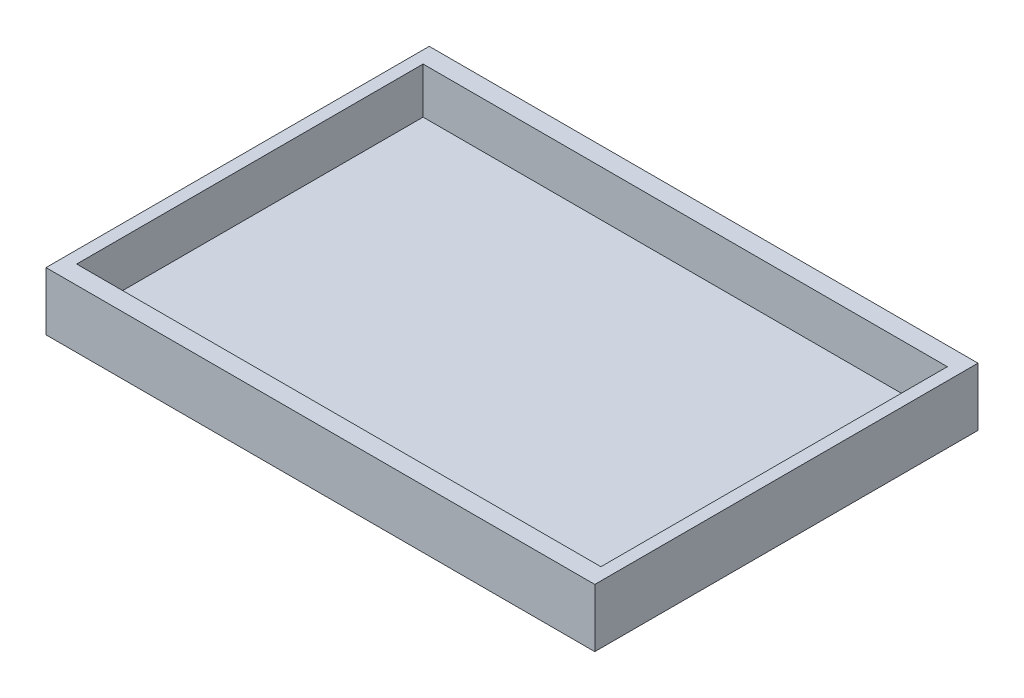
ISO-10303-21;
HEADER;
FILE_DESCRIPTION(('STEP AP214'),'2;1');
FILE_NAME('part.step','',(''),(''),'','','');
FILE_SCHEMA(('AUTOMOTIVE_DESIGN { 1 0 10303 214 1 1 1 1 }'));
ENDSEC;
DATA;
#1=APPLICATION_CONTEXT('core data for automotive mechanical design processes');
#2=APPLICATION_PROTOCOL_DEFINITION('international standard','automotive_design',2000,#1);
#3=PRODUCT_CONTEXT('',#1,'mechanical');
#4=PRODUCT('Part','Part','',(#3));
#5=PRODUCT_RELATED_PRODUCT_CATEGORY('part','',(#4));
#6=PRODUCT_DEFINITION_FORMATION('','',#4);
#7=PRODUCT_DEFINITION_CONTEXT('part definition',#1,'design');
#8=PRODUCT_DEFINITION('design','',#6,#7);
#9=PRODUCT_DEFINITION_SHAPE('','',#8);
#10=(LENGTH_UNIT() NAMED_UNIT(*) SI_UNIT(.MILLI.,.METRE.));
#11=(NAMED_UNIT(*) PLANE_ANGLE_UNIT() SI_UNIT($,.RADIAN.));
#12=(NAMED_UNIT(*) SI_UNIT($,.STERADIAN.) SOLID_ANGLE_UNIT());
#13=UNCERTAINTY_MEASURE_WITH_UNIT(LENGTH_MEASURE(1.E-05),#10,'distance_accuracy_value','');
#14=(GEOMETRIC_REPRESENTATION_CONTEXT(3) GLOBAL_UNCERTAINTY_ASSIGNED_CONTEXT((#13)) GLOBAL_UNIT_ASSIGNED_CONTEXT((#10,
#11,#12)) REPRESENTATION_CONTEXT('',''));
#15=CARTESIAN_POINT('',(0.,0.,0.));
#16=DIRECTION('',(0.,0.,1.));
#17=DIRECTION('',(1.,0.,0.));
#18=AXIS2_PLACEMENT_3D('',#15,#16,#17);
#19=CARTESIAN_POINT('',(44.75,2.,-31.25));
#20=DIRECTION('',(-1.,0.,0.));
#21=DIRECTION('',(0.,0.,1.));
#22=AXIS2_PLACEMENT_3D('',#19,#20,#21);
#23=PLANE('',#22);
#24=DIRECTION('',(0.,0.,-1.));
#25=VECTOR('',#24,1.);
#26=CARTESIAN_POINT('',(44.75,0.,-31.25));
#27=LINE('',#26,#25);
#28=CARTESIAN_POINT('',(44.75,0.,31.25));
#29=VERTEX_POINT('',#28);
#30=CARTESIAN_POINT('',(44.75,0.,-31.25));
#31=VERTEX_POINT('',#30);
#32=EDGE_CURVE('E161',#29,#31,#27,.T.);
#33=ORIENTED_EDGE('',*,*,#32,.T.);
#34=DIRECTION('',(0.,-1.,0.));
#35=VECTOR('',#34,1.);
#36=CARTESIAN_POINT('',(44.75,2.,-31.25));
#37=LINE('',#36,#35);
#38=CARTESIAN_POINT('',(44.75,9.5,-31.25));
#39=VERTEX_POINT('',#38);
#40=EDGE_CURVE('E11',#39,#31,#37,.T.);
#41=ORIENTED_EDGE('',*,*,#40,.F.);
#42=DIRECTION('',(0.,0.,-1.));
#43=VECTOR('',#42,1.);
#44=CARTESIAN_POINT('',(44.75,9.5,0.));
#45=LINE('',#44,#43);
#46=CARTESIAN_POINT('',(44.75,9.5,31.25));
#47=VERTEX_POINT('',#46);
#48=EDGE_CURVE('E123',#47,#39,#45,.T.);
#49=ORIENTED_EDGE('',*,*,#48,.F.);
#50=DIRECTION('',(0.,-1.,0.));
#51=VECTOR('',#50,1.);
#52=CARTESIAN_POINT('',(44.75,2.,31.25));
#53=LINE('',#52,#51);
#54=EDGE_CURVE('E114',#47,#29,#53,.T.);
#55=ORIENTED_EDGE('',*,*,#54,.T.);
#56=EDGE_LOOP('',(#33,#41,#49,#55));
#57=FACE_BOUND('',#56,.T.);
#58=ADVANCED_FACE('F41',(#57),#23,.F.);
#59=CARTESIAN_POINT('',(-44.75,2.,-31.25));
#60=DIRECTION('',(0.,0.,1.));
#61=DIRECTION('',(1.,0.,0.));
#62=AXIS2_PLACEMENT_3D('',#59,#60,#61);
#63=PLANE('',#62);
#64=DIRECTION('',(-1.,0.,0.));
#65=VECTOR('',#64,1.);
#66=CARTESIAN_POINT('',(-44.75,0.,-31.25));
#67=LINE('',#66,#65);
#68=CARTESIAN_POINT('',(-44.75,0.,-31.25));
#69=VERTEX_POINT('',#68);
#70=EDGE_CURVE('E164',#31,#69,#67,.T.);
#71=ORIENTED_EDGE('',*,*,#70,.T.);
#72=DIRECTION('',(0.,-1.,0.));
#73=VECTOR('',#72,1.);
#74=CARTESIAN_POINT('',(-44.75,2.,-31.25));
#75=LINE('',#74,#73);
#76=CARTESIAN_POINT('',(-44.75,9.5,-31.25));
#77=VERTEX_POINT('',#76);
#78=EDGE_CURVE('E48',#77,#69,#75,.T.);
#79=ORIENTED_EDGE('',*,*,#78,.F.);
#80=DIRECTION('',(-1.,0.,0.));
#81=VECTOR('',#80,1.);
#82=CARTESIAN_POINT('',(0.,9.5,-31.25));
#83=LINE('',#82,#81);
#84=EDGE_CURVE('E129',#39,#77,#83,.T.);
#85=ORIENTED_EDGE('',*,*,#84,.F.);
#86=ORIENTED_EDGE('',*,*,#40,.T.);
#87=EDGE_LOOP('',(#71,#79,#85,#86));
#88=FACE_BOUND('',#87,.T.);
#89=ADVANCED_FACE('F174',(#88),#63,.F.);
#90=CARTESIAN_POINT('',(-44.75,2.,-31.25));
#91=DIRECTION('',(1.,0.,0.));
#92=DIRECTION('',(0.,0.,-1.));
#93=AXIS2_PLACEMENT_3D('',#90,#91,#92);
#94=PLANE('',#93);
#95=DIRECTION('',(0.,0.,1.));
#96=VECTOR('',#95,1.);
#97=CARTESIAN_POINT('',(-44.75,0.,-31.25));
#98=LINE('',#97,#96);
#99=CARTESIAN_POINT('',(-44.75,0.,31.25));
#100=VERTEX_POINT('',#99);
#101=EDGE_CURVE('E111',#69,#100,#98,.T.);
#102=ORIENTED_EDGE('',*,*,#101,.T.);
#103=DIRECTION('',(0.,-1.,0.));
#104=VECTOR('',#103,1.);
#105=CARTESIAN_POINT('',(-44.75,2.,31.25));
#106=LINE('',#105,#104);
#107=CARTESIAN_POINT('',(-44.75,9.5,31.25));
#108=VERTEX_POINT('',#107);
#109=EDGE_CURVE('E104',#108,#100,#106,.T.);
#110=ORIENTED_EDGE('',*,*,#109,.F.);
#111=DIRECTION('',(0.,0.,1.));
#112=VECTOR('',#111,1.);
#113=CARTESIAN_POINT('',(-44.75,9.5,0.));
#114=LINE('',#113,#112);
#115=EDGE_CURVE('E109',#77,#108,#114,.T.);
#116=ORIENTED_EDGE('',*,*,#115,.F.);
#117=ORIENTED_EDGE('',*,*,#78,.T.);
#118=EDGE_LOOP('',(#102,#110,#116,#117));
#119=FACE_BOUND('',#118,.T.);
#120=ADVANCED_FACE('F106',(#119),#94,.F.);
#121=CARTESIAN_POINT('',(-44.75,2.,31.25));
#122=DIRECTION('',(0.,0.,-1.));
#123=DIRECTION('',(-1.,0.,0.));
#124=AXIS2_PLACEMENT_3D('',#121,#122,#123);
#125=PLANE('',#124);
#126=DIRECTION('',(1.,0.,0.));
#127=VECTOR('',#126,1.);
#128=CARTESIAN_POINT('',(-44.75,0.,31.25));
#129=LINE('',#128,#127);
#130=EDGE_CURVE('E167',#100,#29,#129,.T.);
#131=ORIENTED_EDGE('',*,*,#130,.T.);
#132=ORIENTED_EDGE('',*,*,#54,.F.);
#133=DIRECTION('',(1.,0.,0.));
#134=VECTOR('',#133,1.);
#135=CARTESIAN_POINT('',(0.,9.5,31.25));
#136=LINE('',#135,#134);
#137=EDGE_CURVE('E117',#108,#47,#136,.T.);
#138=ORIENTED_EDGE('',*,*,#137,.F.);
#139=ORIENTED_EDGE('',*,*,#109,.T.);
#140=EDGE_LOOP('',(#131,#132,#138,#139));
#141=FACE_BOUND('',#140,.T.);
#142=ADVANCED_FACE('F118',(#141),#125,.F.);
#143=CARTESIAN_POINT('',(0.,0.,0.));
#144=DIRECTION('',(0.,1.,0.));
#145=DIRECTION('',(0.,0.,1.));
#146=AXIS2_PLACEMENT_3D('',#143,#144,#145);
#147=PLANE('',#146);
#148=ORIENTED_EDGE('',*,*,#32,.F.);
#149=ORIENTED_EDGE('',*,*,#130,.F.);
#150=ORIENTED_EDGE('',*,*,#101,.F.);
#151=ORIENTED_EDGE('',*,*,#70,.F.);
#152=EDGE_LOOP('',(#148,#149,#150,#151));
#153=FACE_BOUND('',#152,.T.);
#154=ADVANCED_FACE('F172',(#153),#147,.F.);
#155=CARTESIAN_POINT('',(-42.75,9.5,0.));
#156=DIRECTION('',(1.,0.,0.));
#157=DIRECTION('',(0.,0.,-1.));
#158=AXIS2_PLACEMENT_3D('',#155,#156,#157);
#159=PLANE('',#158);
#160=DIRECTION('',(0.,0.,1.));
#161=VECTOR('',#160,1.);
#162=CARTESIAN_POINT('',(-42.75,2.,0.));
#163=LINE('',#162,#161);
#164=CARTESIAN_POINT('',(-42.75,2.,-28.25));
#165=VERTEX_POINT('',#164);
#166=CARTESIAN_POINT('',(-42.75,2.,28.25));
#167=VERTEX_POINT('',#166);
#168=EDGE_CURVE('E148',#165,#167,#163,.T.);
#169=ORIENTED_EDGE('',*,*,#168,.F.);
#170=DIRECTION('',(0.,-1.,0.));
#171=VECTOR('',#170,1.);
#172=CARTESIAN_POINT('',(-42.75,9.5,-28.25));
#173=LINE('',#172,#171);
#174=CARTESIAN_POINT('',(-42.75,9.5,-28.25));
#175=VERTEX_POINT('',#174);
#176=EDGE_CURVE('E159',#175,#165,#173,.T.);
#177=ORIENTED_EDGE('',*,*,#176,.F.);
#178=DIRECTION('',(0.,0.,1.));
#179=VECTOR('',#178,1.);
#180=CARTESIAN_POINT('',(-42.75,9.5,0.));
#181=LINE('',#180,#179);
#182=CARTESIAN_POINT('',(-42.75,9.5,28.25));
#183=VERTEX_POINT('',#182);
#184=EDGE_CURVE('E136',#175,#183,#181,.T.);
#185=ORIENTED_EDGE('',*,*,#184,.T.);
#186=DIRECTION('',(0.,-1.,0.));
#187=VECTOR('',#186,1.);
#188=CARTESIAN_POINT('',(-42.75,9.5,28.25));
#189=LINE('',#188,#187);
#190=EDGE_CURVE('E147',#183,#167,#189,.T.);
#191=ORIENTED_EDGE('',*,*,#190,.T.);
#192=EDGE_LOOP('',(#169,#177,#185,#191));
#193=FACE_BOUND('',#192,.T.);
#194=ADVANCED_FACE('F186',(#193),#159,.T.);
#195=CARTESIAN_POINT('',(0.,9.5,-28.25));
#196=DIRECTION('',(0.,0.,-1.));
#197=DIRECTION('',(-1.,0.,0.));
#198=AXIS2_PLACEMENT_3D('',#195,#196,#197);
#199=PLANE('',#198);
#200=DIRECTION('',(1.,0.,0.));
#201=VECTOR('',#200,1.);
#202=CARTESIAN_POINT('',(0.,2.,-28.25));
#203=LINE('',#202,#201);
#204=CARTESIAN_POINT('',(42.75,2.,-28.25));
#205=VERTEX_POINT('',#204);
#206=EDGE_CURVE('E55',#165,#205,#203,.T.);
#207=ORIENTED_EDGE('',*,*,#206,.T.);
#208=DIRECTION('',(0.,-1.,0.));
#209=VECTOR('',#208,1.);
#210=CARTESIAN_POINT('',(42.75,9.5,-28.25));
#211=LINE('',#210,#209);
#212=CARTESIAN_POINT('',(42.75,9.5,-28.25));
#213=VERTEX_POINT('',#212);
#214=EDGE_CURVE('E157',#213,#205,#211,.T.);
#215=ORIENTED_EDGE('',*,*,#214,.F.);
#216=DIRECTION('',(1.,0.,0.));
#217=VECTOR('',#216,1.);
#218=CARTESIAN_POINT('',(0.,9.5,-28.25));
#219=LINE('',#218,#217);
#220=EDGE_CURVE('E139',#175,#213,#219,.T.);
#221=ORIENTED_EDGE('',*,*,#220,.F.);
#222=ORIENTED_EDGE('',*,*,#176,.T.);
#223=EDGE_LOOP('',(#207,#215,#221,#222));
#224=FACE_BOUND('',#223,.T.);
#225=ADVANCED_FACE('F192',(#224),#199,.F.);
#226=CARTESIAN_POINT('',(42.75,9.5,0.));
#227=DIRECTION('',(1.,0.,0.));
#228=DIRECTION('',(0.,0.,-1.));
#229=AXIS2_PLACEMENT_3D('',#226,#227,#228);
#230=PLANE('',#229);
#231=DIRECTION('',(0.,0.,1.));
#232=VECTOR('',#231,1.);
#233=CARTESIAN_POINT('',(42.75,2.,0.));
#234=LINE('',#233,#232);
#235=CARTESIAN_POINT('',(42.75,2.,28.25));
#236=VERTEX_POINT('',#235);
#237=EDGE_CURVE('E60',#205,#236,#234,.T.);
#238=ORIENTED_EDGE('',*,*,#237,.T.);
#239=DIRECTION('',(0.,-1.,0.));
#240=VECTOR('',#239,1.);
#241=CARTESIAN_POINT('',(42.75,9.5,28.25));
#242=LINE('',#241,#240);
#243=CARTESIAN_POINT('',(42.75,9.5,28.25));
#244=VERTEX_POINT('',#243);
#245=EDGE_CURVE('E154',#244,#236,#242,.T.);
#246=ORIENTED_EDGE('',*,*,#245,.F.);
#247=DIRECTION('',(0.,0.,1.));
#248=VECTOR('',#247,1.);
#249=CARTESIAN_POINT('',(42.75,9.5,0.));
#250=LINE('',#249,#248);
#251=EDGE_CURVE('E142',#213,#244,#250,.T.);
#252=ORIENTED_EDGE('',*,*,#251,.F.);
#253=ORIENTED_EDGE('',*,*,#214,.T.);
#254=EDGE_LOOP('',(#238,#246,#252,#253));
#255=FACE_BOUND('',#254,.T.);
#256=ADVANCED_FACE('F196',(#255),#230,.F.);
#257=CARTESIAN_POINT('',(0.,9.5,28.25));
#258=DIRECTION('',(0.,0.,-1.));
#259=DIRECTION('',(-1.,0.,0.));
#260=AXIS2_PLACEMENT_3D('',#257,#258,#259);
#261=PLANE('',#260);
#262=DIRECTION('',(1.,0.,0.));
#263=VECTOR('',#262,1.);
#264=CARTESIAN_POINT('',(0.,2.,28.25));
#265=LINE('',#264,#263);
#266=EDGE_CURVE('E130',#167,#236,#265,.T.);
#267=ORIENTED_EDGE('',*,*,#266,.F.);
#268=ORIENTED_EDGE('',*,*,#190,.F.);
#269=DIRECTION('',(1.,0.,0.));
#270=VECTOR('',#269,1.);
#271=CARTESIAN_POINT('',(0.,9.5,28.25));
#272=LINE('',#271,#270);
#273=EDGE_CURVE('E144',#183,#244,#272,.T.);
#274=ORIENTED_EDGE('',*,*,#273,.T.);
#275=ORIENTED_EDGE('',*,*,#245,.T.);
#276=EDGE_LOOP('',(#267,#268,#274,#275));
#277=FACE_BOUND('',#276,.T.);
#278=ADVANCED_FACE('F200',(#277),#261,.T.);
#279=CARTESIAN_POINT('',(0.,9.5,0.));
#280=DIRECTION('',(0.,1.,0.));
#281=DIRECTION('',(0.,0.,1.));
#282=AXIS2_PLACEMENT_3D('',#279,#280,#281);
#283=PLANE('',#282);
#284=ORIENTED_EDGE('',*,*,#115,.T.);
#285=ORIENTED_EDGE('',*,*,#137,.T.);
#286=ORIENTED_EDGE('',*,*,#48,.T.);
#287=ORIENTED_EDGE('',*,*,#84,.T.);
#288=EDGE_LOOP('',(#284,#285,#286,#287));
#289=FACE_BOUND('',#288,.T.);
#290=ORIENTED_EDGE('',*,*,#184,.F.);
#291=ORIENTED_EDGE('',*,*,#220,.T.);
#292=ORIENTED_EDGE('',*,*,#251,.T.);
#293=ORIENTED_EDGE('',*,*,#273,.F.);
#294=EDGE_LOOP('',(#290,#291,#292,#293));
#295=FACE_BOUND('',#294,.T.);
#296=ADVANCED_FACE('F126',(#289,#295),#283,.T.);
#297=CARTESIAN_POINT('',(0.,2.,0.));
#298=DIRECTION('',(0.,1.,0.));
#299=DIRECTION('',(0.,0.,1.));
#300=AXIS2_PLACEMENT_3D('',#297,#298,#299);
#301=PLANE('',#300);
#302=ORIENTED_EDGE('',*,*,#168,.T.);
#303=ORIENTED_EDGE('',*,*,#266,.T.);
#304=ORIENTED_EDGE('',*,*,#237,.F.);
#305=ORIENTED_EDGE('',*,*,#206,.F.);
#306=EDGE_LOOP('',(#302,#303,#304,#305));
#307=FACE_BOUND('',#306,.T.);
#308=ADVANCED_FACE('F187',(#307),#301,.T.);
#309=CLOSED_SHELL('',(#58,#89,#120,#142,#154,#194,#225,#256,#278,#296,#308));
#310=MANIFOLD_SOLID_BREP('B2',#309);
#311=ADVANCED_BREP_SHAPE_REPRESENTATION('',(#18,#310),#14);
#312=SHAPE_DEFINITION_REPRESENTATION(#9,#311);
ENDSEC;
END-ISO-10303-21;
